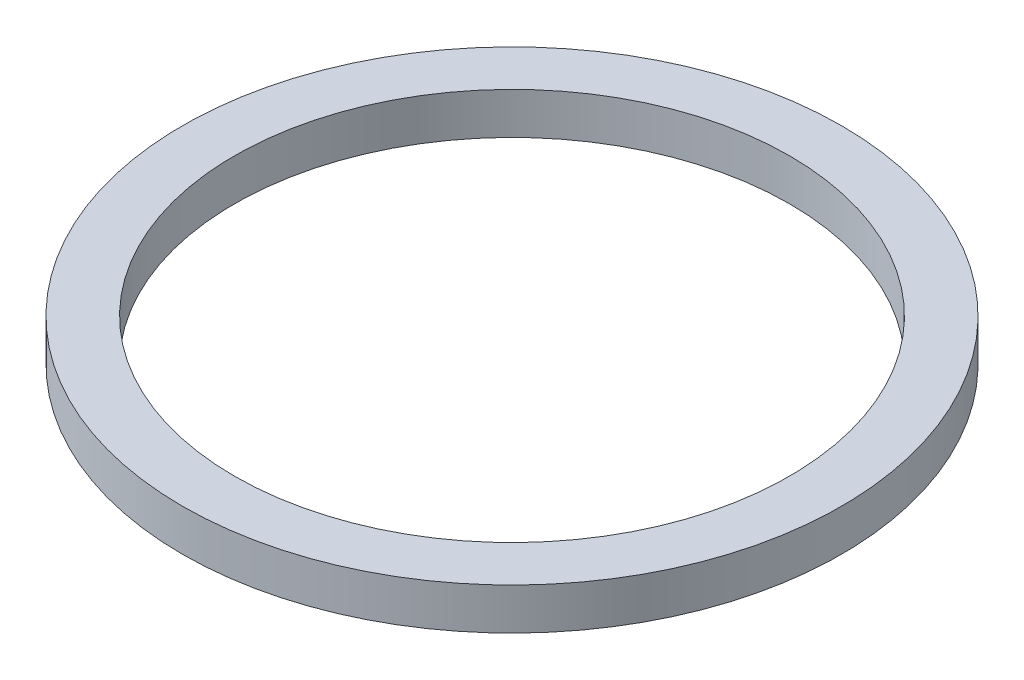
ISO-10303-21;
HEADER;
FILE_DESCRIPTION(('STEP AP214'),'2;1');
FILE_NAME('part.step','',(''),(''),'','','');
FILE_SCHEMA(('AUTOMOTIVE_DESIGN { 1 0 10303 214 1 1 1 1 }'));
ENDSEC;
DATA;
#1=APPLICATION_CONTEXT('core data for automotive mechanical design processes');
#2=APPLICATION_PROTOCOL_DEFINITION('international standard','automotive_design',2000,#1);
#3=PRODUCT_CONTEXT('',#1,'mechanical');
#4=PRODUCT('Part','Part','',(#3));
#5=PRODUCT_RELATED_PRODUCT_CATEGORY('part','',(#4));
#6=PRODUCT_DEFINITION_FORMATION('','',#4);
#7=PRODUCT_DEFINITION_CONTEXT('part definition',#1,'design');
#8=PRODUCT_DEFINITION('design','',#6,#7);
#9=PRODUCT_DEFINITION_SHAPE('','',#8);
#10=(LENGTH_UNIT() NAMED_UNIT(*) SI_UNIT(.MILLI.,.METRE.));
#11=(NAMED_UNIT(*) PLANE_ANGLE_UNIT() SI_UNIT($,.RADIAN.));
#12=(NAMED_UNIT(*) SI_UNIT($,.STERADIAN.) SOLID_ANGLE_UNIT());
#13=UNCERTAINTY_MEASURE_WITH_UNIT(LENGTH_MEASURE(1.E-05),#10,'distance_accuracy_value','');
#14=(GEOMETRIC_REPRESENTATION_CONTEXT(3) GLOBAL_UNCERTAINTY_ASSIGNED_CONTEXT((#13)) GLOBAL_UNIT_ASSIGNED_CONTEXT((#10,
#11,#12)) REPRESENTATION_CONTEXT('',''));
#15=CARTESIAN_POINT('',(0.,0.,0.));
#16=DIRECTION('',(0.,0.,1.));
#17=DIRECTION('',(1.,0.,0.));
#18=AXIS2_PLACEMENT_3D('',#15,#16,#17);
#19=CARTESIAN_POINT('',(0.,6.,0.));
#20=DIRECTION('',(0.,-1.,0.));
#21=DIRECTION('',(0.,0.,-1.));
#22=AXIS2_PLACEMENT_3D('',#19,#20,#21);
#23=CYLINDRICAL_SURFACE('',#22,47.5);
#24=CARTESIAN_POINT('',(0.,6.,0.));
#25=DIRECTION('',(0.,1.,0.));
#26=DIRECTION('',(0.,0.,1.));
#27=AXIS2_PLACEMENT_3D('',#24,#25,#26);
#28=CIRCLE('',#27,47.5);
#29=CARTESIAN_POINT('',(0.,6.,47.5));
#30=VERTEX_POINT('',#29);
#31=EDGE_CURVE('E10',#30,#30,#28,.T.);
#32=ORIENTED_EDGE('',*,*,#31,.F.);
#33=EDGE_LOOP('',(#32));
#34=FACE_BOUND('',#33,.T.);
#35=CARTESIAN_POINT('',(0.,0.,0.));
#36=DIRECTION('',(0.,1.,0.));
#37=DIRECTION('',(0.,0.,1.));
#38=AXIS2_PLACEMENT_3D('',#35,#36,#37);
#39=CIRCLE('',#38,47.5);
#40=CARTESIAN_POINT('',(0.,0.,47.5));
#41=VERTEX_POINT('',#40);
#42=EDGE_CURVE('E37',#41,#41,#39,.T.);
#43=ORIENTED_EDGE('',*,*,#42,.T.);
#44=EDGE_LOOP('',(#43));
#45=FACE_BOUND('',#44,.T.);
#46=ADVANCED_FACE('F40',(#34,#45),#23,.T.);
#47=CARTESIAN_POINT('',(0.,6.,0.));
#48=DIRECTION('',(0.,1.,0.));
#49=DIRECTION('',(0.,0.,1.));
#50=AXIS2_PLACEMENT_3D('',#47,#48,#49);
#51=PLANE('',#50);
#52=CARTESIAN_POINT('',(0.,6.,0.));
#53=DIRECTION('',(0.,1.,0.));
#54=DIRECTION('',(0.,0.,1.));
#55=AXIS2_PLACEMENT_3D('',#52,#53,#54);
#56=CIRCLE('',#55,40.);
#57=CARTESIAN_POINT('',(0.,6.,40.));
#58=VERTEX_POINT('',#57);
#59=EDGE_CURVE('E50',#58,#58,#56,.T.);
#60=ORIENTED_EDGE('',*,*,#59,.F.);
#61=EDGE_LOOP('',(#60));
#62=FACE_BOUND('',#61,.T.);
#63=ORIENTED_EDGE('',*,*,#31,.T.);
#64=EDGE_LOOP('',(#63));
#65=FACE_BOUND('',#64,.T.);
#66=ADVANCED_FACE('F59',(#62,#65),#51,.T.);
#67=CARTESIAN_POINT('',(0.,0.,0.));
#68=DIRECTION('',(0.,1.,0.));
#69=DIRECTION('',(0.,0.,1.));
#70=AXIS2_PLACEMENT_3D('',#67,#68,#69);
#71=PLANE('',#70);
#72=CARTESIAN_POINT('',(0.,0.,0.));
#73=DIRECTION('',(0.,1.,0.));
#74=DIRECTION('',(0.,0.,1.));
#75=AXIS2_PLACEMENT_3D('',#72,#73,#74);
#76=CIRCLE('',#75,40.);
#77=CARTESIAN_POINT('',(0.,0.,40.));
#78=VERTEX_POINT('',#77);
#79=EDGE_CURVE('E47',#78,#78,#76,.T.);
#80=ORIENTED_EDGE('',*,*,#79,.T.);
#81=EDGE_LOOP('',(#80));
#82=FACE_BOUND('',#81,.T.);
#83=ORIENTED_EDGE('',*,*,#42,.F.);
#84=EDGE_LOOP('',(#83));
#85=FACE_BOUND('',#84,.T.);
#86=ADVANCED_FACE('F58',(#82,#85),#71,.F.);
#87=CARTESIAN_POINT('',(0.,6.,0.));
#88=DIRECTION('',(0.,-1.,0.));
#89=DIRECTION('',(0.,0.,-1.));
#90=AXIS2_PLACEMENT_3D('',#87,#88,#89);
#91=CYLINDRICAL_SURFACE('',#90,40.);
#92=ORIENTED_EDGE('',*,*,#59,.T.);
#93=EDGE_LOOP('',(#92));
#94=FACE_BOUND('',#93,.T.);
#95=ORIENTED_EDGE('',*,*,#79,.F.);
#96=EDGE_LOOP('',(#95));
#97=FACE_BOUND('',#96,.T.);
#98=ADVANCED_FACE('F54',(#94,#97),#91,.F.);
#99=CLOSED_SHELL('',(#46,#66,#86,#98));
#100=MANIFOLD_SOLID_BREP('B2',#99);
#101=ADVANCED_BREP_SHAPE_REPRESENTATION('',(#18,#100),#14);
#102=SHAPE_DEFINITION_REPRESENTATION(#9,#101);
ENDSEC;
END-ISO-10303-21;
